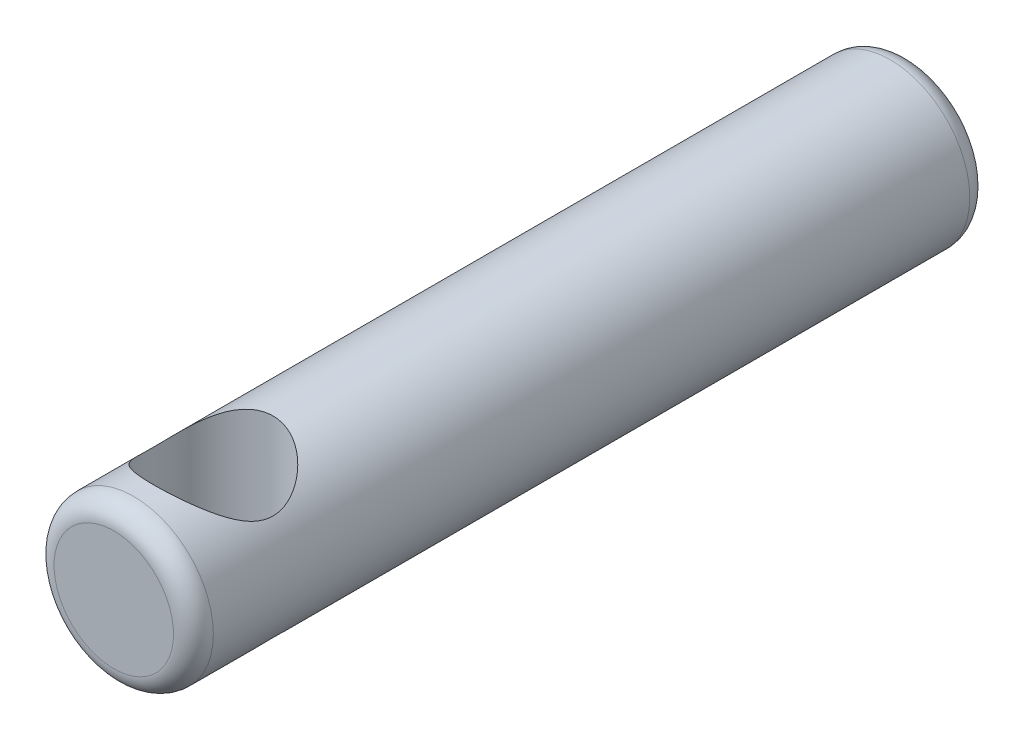
ISO-10303-21;
HEADER;
FILE_DESCRIPTION(('STEP AP214'),'2;1');
FILE_NAME('part.step','',(''),(''),'','','');
FILE_SCHEMA(('AUTOMOTIVE_DESIGN { 1 0 10303 214 1 1 1 1 }'));
ENDSEC;
DATA;
#1=APPLICATION_CONTEXT('core data for automotive mechanical design processes');
#2=APPLICATION_PROTOCOL_DEFINITION('international standard','automotive_design',2000,#1);
#3=PRODUCT_CONTEXT('',#1,'mechanical');
#4=PRODUCT('Part','Part','',(#3));
#5=PRODUCT_RELATED_PRODUCT_CATEGORY('part','',(#4));
#6=PRODUCT_DEFINITION_FORMATION('','',#4);
#7=PRODUCT_DEFINITION_CONTEXT('part definition',#1,'design');
#8=PRODUCT_DEFINITION('design','',#6,#7);
#9=PRODUCT_DEFINITION_SHAPE('','',#8);
#10=(LENGTH_UNIT() NAMED_UNIT(*) SI_UNIT(.MILLI.,.METRE.));
#11=(NAMED_UNIT(*) PLANE_ANGLE_UNIT() SI_UNIT($,.RADIAN.));
#12=(NAMED_UNIT(*) SI_UNIT($,.STERADIAN.) SOLID_ANGLE_UNIT());
#13=UNCERTAINTY_MEASURE_WITH_UNIT(LENGTH_MEASURE(1.E-05),#10,'distance_accuracy_value','');
#14=(GEOMETRIC_REPRESENTATION_CONTEXT(3) GLOBAL_UNCERTAINTY_ASSIGNED_CONTEXT((#13)) GLOBAL_UNIT_ASSIGNED_CONTEXT((#10,
#11,#12)) REPRESENTATION_CONTEXT('',''));
#15=CARTESIAN_POINT('',(0.,0.,0.));
#16=DIRECTION('',(0.,0.,1.));
#17=DIRECTION('',(1.,0.,0.));
#18=AXIS2_PLACEMENT_3D('',#15,#16,#17);
#19=CARTESIAN_POINT('',(0.,0.,20.));
#20=DIRECTION('',(0.,0.,-1.));
#21=DIRECTION('',(-1.,0.,0.));
#22=AXIS2_PLACEMENT_3D('',#19,#20,#21);
#23=CYLINDRICAL_SURFACE('',#22,2.);
#24=CARTESIAN_POINT('',(0.,0.,19.5));
#25=DIRECTION('',(0.,0.,1.));
#26=DIRECTION('',(1.,0.,0.));
#27=AXIS2_PLACEMENT_3D('',#24,#25,#26);
#28=CIRCLE('',#27,2.);
#29=CARTESIAN_POINT('',(2.,0.,19.5));
#30=VERTEX_POINT('',#29);
#31=EDGE_CURVE('E46',#30,#30,#28,.F.);
#32=ORIENTED_EDGE('',*,*,#31,.T.);
#33=EDGE_LOOP('',(#32));
#34=FACE_BOUND('',#33,.T.);
#35=CARTESIAN_POINT('',(0.,0.,0.5));
#36=DIRECTION('',(0.,0.,1.));
#37=DIRECTION('',(1.,0.,0.));
#38=AXIS2_PLACEMENT_3D('',#35,#36,#37);
#39=CIRCLE('',#38,2.);
#40=CARTESIAN_POINT('',(2.,0.,0.5));
#41=VERTEX_POINT('',#40);
#42=EDGE_CURVE('E50',#41,#41,#39,.T.);
#43=ORIENTED_EDGE('',*,*,#42,.T.);
#44=EDGE_LOOP('',(#43));
#45=FACE_BOUND('',#44,.T.);
#46=CARTESIAN_POINT('',(0.,-2.,19.));
#47=CARTESIAN_POINT('',(0.0732207358411564,-1.99999540196395,18.999995207988));
#48=CARTESIAN_POINT('',(0.146561062021487,-1.99593645526274,18.9945949756255));
#49=CARTESIAN_POINT('',(0.290936396286469,-1.98006607281083,18.9733329365898));
#50=CARTESIAN_POINT('',(0.361965136229007,-1.96823514679854,18.95744482835));
#51=CARTESIAN_POINT('',(0.499234626631252,-1.9379567495606,18.9162870907162));
#52=CARTESIAN_POINT('',(0.565501615403739,-1.91954951932009,18.8910744864308));
#53=CARTESIAN_POINT('',(0.692422335520755,-1.87750556721694,18.8324576558128));
#54=CARTESIAN_POINT('',(0.753077701796335,-1.85387037535483,18.7990558258065));
#55=CARTESIAN_POINT('',(0.873465937590148,-1.80049544543983,18.7217369884092));
#56=CARTESIAN_POINT('',(0.932593229272034,-1.77039308548439,18.6771326706659));
#57=CARTESIAN_POINT('',(1.04302716767671,-1.70767017883377,18.5805041626388));
#58=CARTESIAN_POINT('',(1.09432148272226,-1.67504578078609,18.5284685172002));
#59=CARTESIAN_POINT('',(1.19837161436623,-1.6027112365199,18.4064170467216));
#60=CARTESIAN_POINT('',(1.24930578421205,-1.56290854864639,18.3348963228783));
#61=CARTESIAN_POINT('',(1.33861998176348,-1.48711444664135,18.1825489876335));
#62=CARTESIAN_POINT('',(1.37701716983077,-1.45111786883675,18.1017353029997));
#63=CARTESIAN_POINT('',(1.42880627811789,-1.39977155180178,17.9604971613238));
#64=CARTESIAN_POINT('',(1.44625674456539,-1.38157751186733,17.9026093028716));
#65=CARTESIAN_POINT('',(1.47420672564844,-1.35171594150685,17.7836072652151));
#66=CARTESIAN_POINT('',(1.48472215355267,-1.34003347910831,17.7225008221252));
#67=CARTESIAN_POINT('',(1.49812822141446,-1.32503759684552,17.5978174144692));
#68=CARTESIAN_POINT('',(1.50094954854207,-1.32180026676597,17.5342231932759));
#69=CARTESIAN_POINT('',(1.49848213241869,-1.32459531776068,17.4073850891184));
#70=CARTESIAN_POINT('',(1.4931904815735,-1.33063102218113,17.3441413399126));
#71=CARTESIAN_POINT('',(1.47597739291882,-1.34967623262518,17.2268086525742));
#72=CARTESIAN_POINT('',(1.46482486380817,-1.36187157059871,17.1724636289538));
#73=CARTESIAN_POINT('',(1.43705671120733,-1.39114192844939,17.0665611212791));
#74=CARTESIAN_POINT('',(1.42043583681173,-1.40822163640768,17.0150063721764));
#75=CARTESIAN_POINT('',(1.37033064172535,-1.45741769294306,16.8837436133659));
#76=CARTESIAN_POINT('',(1.33280148493981,-1.49225649139232,16.8065995833565));
#77=CARTESIAN_POINT('',(1.2461802331452,-1.56533298145195,16.6608034761309));
#78=CARTESIAN_POINT('',(1.19706004255879,-1.60357878886109,16.5921726607453));
#79=CARTESIAN_POINT('',(1.08651604102136,-1.68051672313145,16.4622466095963));
#80=CARTESIAN_POINT('',(1.02481375526037,-1.71919586730239,16.4011793931185));
#81=CARTESIAN_POINT('',(0.890422521709596,-1.79248037980972,16.2897363532188));
#82=CARTESIAN_POINT('',(0.817755054293763,-1.8270934826376,16.2393400797696));
#83=CARTESIAN_POINT('',(0.677902080454148,-1.88279726073643,16.1600192007597));
#84=CARTESIAN_POINT('',(0.612539870185625,-1.90520770945008,16.1288154057842));
#85=CARTESIAN_POINT('',(0.476352173202091,-1.94372904416948,16.0757751195361));
#86=CARTESIAN_POINT('',(0.40553014106377,-1.95984387504352,16.0539327615007));
#87=CARTESIAN_POINT('',(0.259676232483522,-1.98445588635989,16.0207466371136));
#88=CARTESIAN_POINT('',(0.184621281405946,-1.99290592971749,16.0094678210614));
#89=CARTESIAN_POINT('',(0.0332012397969196,-2.00115883659445,15.9984504026283));
#90=CARTESIAN_POINT('',(-0.0431632843727212,-2.00096534845408,15.9987069313046));
#91=CARTESIAN_POINT('',(-0.186804217329623,-1.99242547175873,16.0101108692732));
#92=CARTESIAN_POINT('',(-0.254222327546131,-1.98490086600401,16.0201605368887));
#93=CARTESIAN_POINT('',(-0.386110670609116,-1.96351320201588,16.0489737800079));
#94=CARTESIAN_POINT('',(-0.450580272987259,-1.94964879507262,16.0677392096894));
#95=CARTESIAN_POINT('',(-0.577416779689766,-1.91599830683313,16.1138875305931));
#96=CARTESIAN_POINT('',(-0.639629172536136,-1.89602050290194,16.1415511814274));
#97=CARTESIAN_POINT('',(-0.75851852704307,-1.85166985411963,16.2041724554256));
#98=CARTESIAN_POINT('',(-0.8151947213364,-1.82729640132068,16.2391310876397));
#99=CARTESIAN_POINT('',(-0.931511626319035,-1.77119146886499,16.3217832464106));
#100=CARTESIAN_POINT('',(-0.9900667626987,-1.73891095025037,16.3706285394375));
#101=CARTESIAN_POINT('',(-1.09871974855854,-1.67238952874785,16.4760087525884));
#102=CARTESIAN_POINT('',(-1.14879830469577,-1.63814438507395,16.5325606996934));
#103=CARTESIAN_POINT('',(-1.24877541075626,-1.56369128291497,16.6641498809612));
#104=CARTESIAN_POINT('',(-1.29683043648705,-1.52358718520101,16.7406575614923));
#105=CARTESIAN_POINT('',(-1.37923235998282,-1.44940591348451,16.9033600779725));
#106=CARTESIAN_POINT('',(-1.41362000515519,-1.41531099570969,16.9895251219086));
#107=CARTESIAN_POINT('',(-1.45615734256767,-1.37118877808583,17.1354144488745));
#108=CARTESIAN_POINT('',(-1.46931009512996,-1.35695811824565,17.1923911264024));
#109=CARTESIAN_POINT('',(-1.48891522181906,-1.33542056103011,17.3087070469832));
#110=CARTESIAN_POINT('',(-1.4953825519924,-1.32809821220233,17.3680407068023));
#111=CARTESIAN_POINT('',(-1.50115320209064,-1.32157601792209,17.4878290798113));
#112=CARTESIAN_POINT('',(-1.50042015325262,-1.32241740684975,17.5482879430096));
#113=CARTESIAN_POINT('',(-1.49176883838219,-1.33216448543667,17.6680568387522));
#114=CARTESIAN_POINT('',(-1.48384130024584,-1.34108058157484,17.7273652878973));
#115=CARTESIAN_POINT('',(-1.45893841819723,-1.36817348797773,17.8559145714108));
#116=CARTESIAN_POINT('',(-1.44036567954111,-1.38794705950643,17.9244971801328));
#117=CARTESIAN_POINT('',(-1.39469627266118,-1.4338296338541,18.0565348488305));
#118=CARTESIAN_POINT('',(-1.3675780729773,-1.4599546014693,18.1199764420382));
#119=CARTESIAN_POINT('',(-1.29498918933642,-1.52516477328824,18.2625206304863));
#120=CARTESIAN_POINT('',(-1.2464154206597,-1.56560203191105,18.3394215827558));
#121=CARTESIAN_POINT('',(-1.13650718465936,-1.64713510181273,18.4831260449776));
#122=CARTESIAN_POINT('',(-1.07516134758577,-1.68823146954223,18.5499204659449));
#123=CARTESIAN_POINT('',(-0.939627144937889,-1.76728988939794,18.6728318422833));
#124=CARTESIAN_POINT('',(-0.865337161562856,-1.80522333711072,18.7288563193772));
#125=CARTESIAN_POINT('',(-0.705159098936198,-1.87357289668097,18.8272230511454));
#126=CARTESIAN_POINT('',(-0.619299420401788,-1.90400691592959,18.8695979745725));
#127=CARTESIAN_POINT('',(-0.464840290356448,-1.94636704624048,18.9277994209857));
#128=CARTESIAN_POINT('',(-0.398553614774726,-1.96110322499718,18.9477667313762));
#129=CARTESIAN_POINT('',(-0.262841610392753,-1.98383739970238,18.9784179026115));
#130=CARTESIAN_POINT('',(-0.193425623834899,-1.99185421210894,18.98912769025));
#131=CARTESIAN_POINT('',(-0.102963309861883,-1.99745471706309,18.9966046942144));
#132=CARTESIAN_POINT('',(-0.0824069459941185,-1.9984076143208,18.9978762774894));
#133=CARTESIAN_POINT('',(-0.0412368896243747,-1.99968095423138,18.999574673231));
#134=CARTESIAN_POINT('',(-0.0206231884283852,-2.00000129507253,19.0000013497074));
#135=CARTESIAN_POINT('',(0.,-2.,19.));
#136=B_SPLINE_CURVE_WITH_KNOTS('',3,(#46,#47,#48,#49,#50,#51,#52,#53,#54,#55,#56,#57,#58,#59,
#60,#61,#62,#63,#64,#65,#66,#67,#68,#69,#70,#71,#72,#73,#74,#75,#76,#77,#78,#79,#80,#81,#82,#83,
#84,#85,#86,#87,#88,#89,#90,#91,#92,#93,#94,#95,#96,#97,#98,#99,#100,#101,#102,#103,#104,#105,
#106,#107,#108,#109,#110,#111,#112,#113,#114,#115,#116,#117,#118,#119,#120,#121,#122,#123,#124,
#125,#126,#127,#128,#129,#130,#131,#132,#133,#134,#135),.UNSPECIFIED.,.T.,.F.,(4,2,2,2,2,2,2,2,
2,2,2,2,2,2,2,2,2,2,2,2,2,2,2,2,2,2,2,2,2,2,2,2,2,2,2,2,2,2,2,2,2,2,2,2,4),(0.,
0.219571786572042,0.439696319423244,0.658496333573382,0.877232398849293,1.1162243131743,
1.35558868405163,1.64360015887451,1.93121574056507,2.11999518529902,2.3083399319529,
2.49837587621257,2.6884799430021,2.85826890162709,3.0282213760064,3.3044933180591,
3.58144192357889,3.86535883938091,4.14872662493691,4.3752650500639,4.60166129643118,
4.82944058166899,5.05712372466614,5.26191187011995,5.46674360185813,5.6788043948368,
5.89089453977541,6.13840382081868,6.38646908985452,6.68168596015947,6.97601595850113,
7.15589161422934,7.33536399114209,7.51574333854742,7.69635548563855,7.91639670960136,
8.13699685139923,8.43412246655769,8.73151372390894,9.03135449492651,9.33047220273166,
9.54195697541631,9.75284752283258,9.81468166878712,9.87652576630967),.UNSPECIFIED.);
#137=CARTESIAN_POINT('',(0.,-2.,19.));
#138=VERTEX_POINT('',#137);
#139=EDGE_CURVE('E59',#138,#138,#136,.T.);
#140=ORIENTED_EDGE('',*,*,#139,.T.);
#141=EDGE_LOOP('',(#140));
#142=FACE_BOUND('',#141,.T.);
#143=CARTESIAN_POINT('',(0.,2.,19.));
#144=CARTESIAN_POINT('',(-0.0732207358411544,1.99999540196395,18.999995207988));
#145=CARTESIAN_POINT('',(-0.146561062021485,1.99593645526274,18.9945949756255));
#146=CARTESIAN_POINT('',(-0.290936396286467,1.98006607281083,18.9733329365898));
#147=CARTESIAN_POINT('',(-0.361965136229005,1.96823514679854,18.9574448283499));
#148=CARTESIAN_POINT('',(-0.499234626631249,1.9379567495606,18.9162870907162));
#149=CARTESIAN_POINT('',(-0.565501615403737,1.91954951932009,18.8910744864308));
#150=CARTESIAN_POINT('',(-0.692422335520752,1.87750556721694,18.8324576558128));
#151=CARTESIAN_POINT('',(-0.753077701796332,1.85387037535483,18.7990558258065));
#152=CARTESIAN_POINT('',(-0.873465937590146,1.80049544543983,18.7217369884092));
#153=CARTESIAN_POINT('',(-0.932593229272034,1.77039308548439,18.6771326706659));
#154=CARTESIAN_POINT('',(-1.04302716767671,1.70767017883377,18.5805041626388));
#155=CARTESIAN_POINT('',(-1.09432148272226,1.67504578078609,18.5284685172002));
#156=CARTESIAN_POINT('',(-1.19837161436623,1.6027112365199,18.4064170467216));
#157=CARTESIAN_POINT('',(-1.24930578421204,1.56290854864639,18.3348963228783));
#158=CARTESIAN_POINT('',(-1.33861998176348,1.48711444664135,18.1825489876335));
#159=CARTESIAN_POINT('',(-1.37701716983077,1.45111786883675,18.1017353029997));
#160=CARTESIAN_POINT('',(-1.42880627811788,1.39977155180179,17.9604971613238));
#161=CARTESIAN_POINT('',(-1.44625674456539,1.38157751186733,17.9026093028716));
#162=CARTESIAN_POINT('',(-1.47420672564844,1.35171594150685,17.7836072652151));
#163=CARTESIAN_POINT('',(-1.48472215355267,1.34003347910832,17.7225008221252));
#164=CARTESIAN_POINT('',(-1.49812822141445,1.32503759684553,17.5978174144692));
#165=CARTESIAN_POINT('',(-1.50094954854207,1.32180026676597,17.5342231932759));
#166=CARTESIAN_POINT('',(-1.49848213241869,1.32459531776068,17.4073850891184));
#167=CARTESIAN_POINT('',(-1.49319048157349,1.33063102218113,17.3441413399126));
#168=CARTESIAN_POINT('',(-1.47597739291882,1.34967623262519,17.2268086525742));
#169=CARTESIAN_POINT('',(-1.46482486380817,1.36187157059871,17.1724636289538));
#170=CARTESIAN_POINT('',(-1.43705671120732,1.39114192844939,17.0665611212791));
#171=CARTESIAN_POINT('',(-1.42043583681172,1.40822163640769,17.0150063721764));
#172=CARTESIAN_POINT('',(-1.37033064172534,1.45741769294306,16.8837436133658));
#173=CARTESIAN_POINT('',(-1.3328014849398,1.49225649139233,16.8065995833565));
#174=CARTESIAN_POINT('',(-1.24618023314519,1.56533298145196,16.6608034761309));
#175=CARTESIAN_POINT('',(-1.19706004255878,1.6035787888611,16.5921726607453));
#176=CARTESIAN_POINT('',(-1.08651604102135,1.68051672313145,16.4622466095963));
#177=CARTESIAN_POINT('',(-1.02481375526036,1.7191958673024,16.4011793931185));
#178=CARTESIAN_POINT('',(-0.890422521709585,1.79248037980973,16.2897363532188));
#179=CARTESIAN_POINT('',(-0.817755054293751,1.8270934826376,16.2393400797696));
#180=CARTESIAN_POINT('',(-0.677902080454137,1.88279726073643,16.1600192007597));
#181=CARTESIAN_POINT('',(-0.612539870185614,1.90520770945008,16.1288154057842));
#182=CARTESIAN_POINT('',(-0.476352173202081,1.94372904416948,16.0757751195361));
#183=CARTESIAN_POINT('',(-0.405530141063761,1.95984387504352,16.0539327615007));
#184=CARTESIAN_POINT('',(-0.259676232483514,1.98445588635989,16.0207466371136));
#185=CARTESIAN_POINT('',(-0.184621281405938,1.99290592971749,16.0094678210614));
#186=CARTESIAN_POINT('',(-0.0332012397969135,2.00115883659445,15.9984504026283));
#187=CARTESIAN_POINT('',(0.0431632843727269,2.00096534845408,15.9987069313046));
#188=CARTESIAN_POINT('',(0.186804217329628,1.99242547175873,16.0101108692732));
#189=CARTESIAN_POINT('',(0.254222327546136,1.98490086600401,16.0201605368887));
#190=CARTESIAN_POINT('',(0.386110670609121,1.96351320201588,16.0489737800079));
#191=CARTESIAN_POINT('',(0.450580272987264,1.94964879507262,16.0677392096894));
#192=CARTESIAN_POINT('',(0.577416779689772,1.91599830683313,16.1138875305931));
#193=CARTESIAN_POINT('',(0.639629172536142,1.89602050290193,16.1415511814274));
#194=CARTESIAN_POINT('',(0.758518527043076,1.85166985411963,16.2041724554256));
#195=CARTESIAN_POINT('',(0.815194721336407,1.82729640132067,16.2391310876397));
#196=CARTESIAN_POINT('',(0.931511626319041,1.77119146886499,16.3217832464106));
#197=CARTESIAN_POINT('',(0.990066762698707,1.73891095025037,16.3706285394375));
#198=CARTESIAN_POINT('',(1.09871974855854,1.67238952874784,16.4760087525884));
#199=CARTESIAN_POINT('',(1.14879830469577,1.63814438507395,16.5325606996934));
#200=CARTESIAN_POINT('',(1.24877541075627,1.56369128291496,16.6641498809612));
#201=CARTESIAN_POINT('',(1.29683043648705,1.523587185201,16.7406575614923));
#202=CARTESIAN_POINT('',(1.37923235998283,1.4494059134845,16.9033600779725));
#203=CARTESIAN_POINT('',(1.41362000515519,1.41531099570969,16.9895251219086));
#204=CARTESIAN_POINT('',(1.45615734256768,1.37118877808582,17.1354144488745));
#205=CARTESIAN_POINT('',(1.46931009512996,1.35695811824564,17.1923911264024));
#206=CARTESIAN_POINT('',(1.48891522181907,1.3354205610301,17.3087070469832));
#207=CARTESIAN_POINT('',(1.4953825519924,1.32809821220233,17.3680407068023));
#208=CARTESIAN_POINT('',(1.50115320209065,1.32157601792208,17.4878290798113));
#209=CARTESIAN_POINT('',(1.50042015325262,1.32241740684975,17.5482879430096));
#210=CARTESIAN_POINT('',(1.49176883838219,1.33216448543666,17.6680568387522));
#211=CARTESIAN_POINT('',(1.48384130024585,1.34108058157484,17.7273652878973));
#212=CARTESIAN_POINT('',(1.45893841819723,1.36817348797772,17.8559145714108));
#213=CARTESIAN_POINT('',(1.44036567954112,1.38794705950643,17.9244971801328));
#214=CARTESIAN_POINT('',(1.39469627266119,1.4338296338541,18.0565348488305));
#215=CARTESIAN_POINT('',(1.3675780729773,1.4599546014693,18.1199764420382));
#216=CARTESIAN_POINT('',(1.29498918933642,1.52516477328824,18.2625206304863));
#217=CARTESIAN_POINT('',(1.2464154206597,1.56560203191105,18.3394215827558));
#218=CARTESIAN_POINT('',(1.13650718465936,1.64713510181273,18.4831260449776));
#219=CARTESIAN_POINT('',(1.07516134758577,1.68823146954223,18.5499204659449));
#220=CARTESIAN_POINT('',(0.939627144937883,1.76728988939794,18.6728318422833));
#221=CARTESIAN_POINT('',(0.865337161562851,1.80522333711072,18.7288563193772));
#222=CARTESIAN_POINT('',(0.705159098936193,1.87357289668097,18.8272230511454));
#223=CARTESIAN_POINT('',(0.619299420401782,1.90400691592959,18.8695979745725));
#224=CARTESIAN_POINT('',(0.464840290356441,1.94636704624048,18.9277994209857));
#225=CARTESIAN_POINT('',(0.398553614774719,1.96110322499718,18.9477667313762));
#226=CARTESIAN_POINT('',(0.262841610392747,1.98383739970238,18.9784179026115));
#227=CARTESIAN_POINT('',(0.193425623834892,1.99185421210894,18.98912769025));
#228=CARTESIAN_POINT('',(0.102963309861878,1.99745471706309,18.9966046942144));
#229=CARTESIAN_POINT('',(0.082406945994115,1.9984076143208,18.9978762774894));
#230=CARTESIAN_POINT('',(0.0412368896243743,1.99968095423138,18.999574673231));
#231=CARTESIAN_POINT('',(0.0206231884283861,2.00000129507253,19.0000013497074));
#232=CARTESIAN_POINT('',(0.,2.,19.));
#233=B_SPLINE_CURVE_WITH_KNOTS('',3,(#143,#144,#145,#146,#147,#148,#149,#150,#151,#152,#153,
#154,#155,#156,#157,#158,#159,#160,#161,#162,#163,#164,#165,#166,#167,#168,#169,#170,#171,#172,
#173,#174,#175,#176,#177,#178,#179,#180,#181,#182,#183,#184,#185,#186,#187,#188,#189,#190,#191,
#192,#193,#194,#195,#196,#197,#198,#199,#200,#201,#202,#203,#204,#205,#206,#207,#208,#209,#210,
#211,#212,#213,#214,#215,#216,#217,#218,#219,#220,#221,#222,#223,#224,#225,#226,#227,#228,#229,
#230,#231,#232),.UNSPECIFIED.,.T.,.F.,(4,2,2,2,2,2,2,2,2,2,2,2,2,2,2,2,2,2,2,2,2,2,2,2,2,2,2,2,
2,2,2,2,2,2,2,2,2,2,2,2,2,2,2,2,4),(0.,0.219571786572042,0.439696319423243,0.658496333573382,
0.877232398849294,1.1162243131743,1.35558868405163,1.64360015887451,1.93121574056507,
2.11999518529901,2.3083399319529,2.49837587621257,2.6884799430021,2.85826890162709,
3.0282213760064,3.3044933180591,3.5814419235789,3.86535883938091,4.14872662493691,
4.3752650500639,4.60166129643118,4.82944058166899,5.05712372466614,5.26191187011994,
5.46674360185812,5.6788043948368,5.89089453977541,6.13840382081869,6.38646908985452,
6.68168596015948,6.97601595850113,7.15589161422934,7.33536399114209,7.51574333854743,
7.69635548563855,7.91639670960136,8.13699685139923,8.4341224665577,8.73151372390895,
9.03135449492652,9.33047220273166,9.54195697541632,9.75284752283259,9.81468166878713,
9.87652576630967),.UNSPECIFIED.);
#234=CARTESIAN_POINT('',(0.,2.,19.));
#235=VERTEX_POINT('',#234);
#236=EDGE_CURVE('E67',#235,#235,#233,.T.);
#237=ORIENTED_EDGE('',*,*,#236,.T.);
#238=EDGE_LOOP('',(#237));
#239=FACE_BOUND('',#238,.T.);
#240=ADVANCED_FACE('F39',(#34,#45,#142,#239),#23,.T.);
#241=CARTESIAN_POINT('',(0.,0.,20.));
#242=DIRECTION('',(0.,0.,1.));
#243=DIRECTION('',(1.,0.,0.));
#244=AXIS2_PLACEMENT_3D('',#241,#242,#243);
#245=PLANE('',#244);
#246=CARTESIAN_POINT('',(0.,0.,20.));
#247=DIRECTION('',(0.,0.,1.));
#248=DIRECTION('',(1.,0.,0.));
#249=AXIS2_PLACEMENT_3D('',#246,#247,#248);
#250=CIRCLE('',#249,1.5);
#251=CARTESIAN_POINT('',(1.5,0.,20.));
#252=VERTEX_POINT('',#251);
#253=EDGE_CURVE('E54',#252,#252,#250,.T.);
#254=ORIENTED_EDGE('',*,*,#253,.T.);
#255=EDGE_LOOP('',(#254));
#256=FACE_BOUND('',#255,.T.);
#257=ADVANCED_FACE('F80',(#256),#245,.T.);
#258=CARTESIAN_POINT('',(0.,0.,0.));
#259=DIRECTION('',(0.,0.,1.));
#260=DIRECTION('',(1.,0.,0.));
#261=AXIS2_PLACEMENT_3D('',#258,#259,#260);
#262=PLANE('',#261);
#263=CARTESIAN_POINT('',(0.,0.,0.));
#264=DIRECTION('',(0.,0.,1.));
#265=DIRECTION('',(1.,0.,0.));
#266=AXIS2_PLACEMENT_3D('',#263,#264,#265);
#267=CIRCLE('',#266,1.5);
#268=CARTESIAN_POINT('',(1.5,0.,0.));
#269=VERTEX_POINT('',#268);
#270=EDGE_CURVE('E10',#269,#269,#267,.F.);
#271=ORIENTED_EDGE('',*,*,#270,.T.);
#272=EDGE_LOOP('',(#271));
#273=FACE_BOUND('',#272,.T.);
#274=ADVANCED_FACE('F78',(#273),#262,.F.);
#275=CARTESIAN_POINT('',(0.,-2.,17.5));
#276=DIRECTION('',(0.,1.,0.));
#277=DIRECTION('',(0.,0.,1.));
#278=AXIS2_PLACEMENT_3D('',#275,#276,#277);
#279=CYLINDRICAL_SURFACE('',#278,1.5);
#280=ORIENTED_EDGE('',*,*,#236,.F.);
#281=EDGE_LOOP('',(#280));
#282=FACE_BOUND('',#281,.T.);
#283=ORIENTED_EDGE('',*,*,#139,.F.);
#284=EDGE_LOOP('',(#283));
#285=FACE_BOUND('',#284,.T.);
#286=ADVANCED_FACE('F73',(#282,#285),#279,.F.);
#287=CARTESIAN_POINT('',(0.,0.,19.5));
#288=DIRECTION('',(0.,0.,1.));
#289=DIRECTION('',(1.,0.,0.));
#290=AXIS2_PLACEMENT_3D('',#287,#288,#289);
#291=TOROIDAL_SURFACE('',#290,1.5,0.5);
#292=ORIENTED_EDGE('',*,*,#31,.F.);
#293=EDGE_LOOP('',(#292));
#294=FACE_BOUND('',#293,.T.);
#295=ORIENTED_EDGE('',*,*,#253,.F.);
#296=EDGE_LOOP('',(#295));
#297=FACE_BOUND('',#296,.T.);
#298=ADVANCED_FACE('F77',(#294,#297),#291,.T.);
#299=CARTESIAN_POINT('',(0.,0.,0.5));
#300=DIRECTION('',(0.,0.,1.));
#301=DIRECTION('',(1.,0.,0.));
#302=AXIS2_PLACEMENT_3D('',#299,#300,#301);
#303=TOROIDAL_SURFACE('',#302,1.5,0.5);
#304=ORIENTED_EDGE('',*,*,#270,.F.);
#305=EDGE_LOOP('',(#304));
#306=FACE_BOUND('',#305,.T.);
#307=ORIENTED_EDGE('',*,*,#42,.F.);
#308=EDGE_LOOP('',(#307));
#309=FACE_BOUND('',#308,.T.);
#310=ADVANCED_FACE('F41',(#306,#309),#303,.T.);
#311=CLOSED_SHELL('',(#240,#257,#274,#286,#298,#310));
#312=MANIFOLD_SOLID_BREP('B2',#311);
#313=ADVANCED_BREP_SHAPE_REPRESENTATION('',(#18,#312),#14);
#314=SHAPE_DEFINITION_REPRESENTATION(#9,#313);
ENDSEC;
END-ISO-10303-21;
